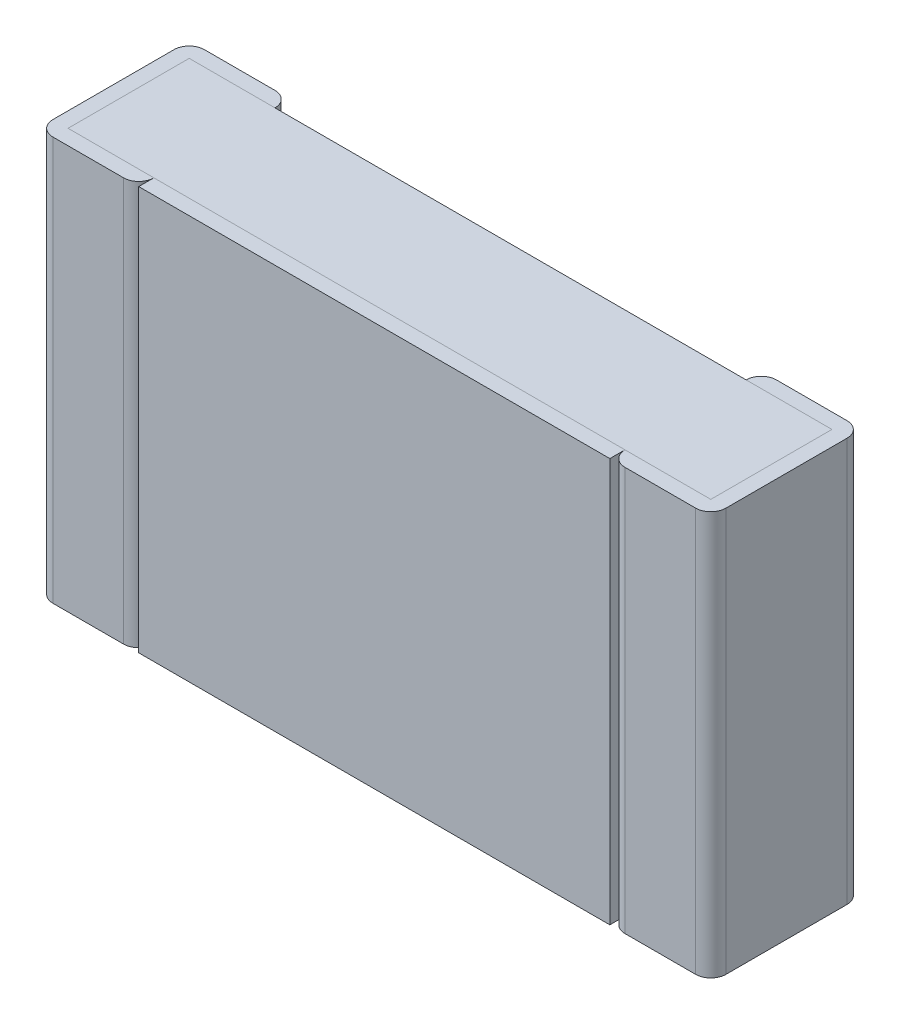
ISO-10303-21;
HEADER;
FILE_DESCRIPTION(('STEP AP214'),'2;1');
FILE_NAME('part.step','',(''),(''),'','','');
FILE_SCHEMA(('AUTOMOTIVE_DESIGN { 1 0 10303 214 1 1 1 1 }'));
ENDSEC;
DATA;
#1=APPLICATION_CONTEXT('core data for automotive mechanical design processes');
#2=APPLICATION_PROTOCOL_DEFINITION('international standard','automotive_design',2000,#1);
#3=PRODUCT_CONTEXT('',#1,'mechanical');
#4=PRODUCT('Part','Part','',(#3));
#5=PRODUCT_RELATED_PRODUCT_CATEGORY('part','',(#4));
#6=PRODUCT_DEFINITION_FORMATION('','',#4);
#7=PRODUCT_DEFINITION_CONTEXT('part definition',#1,'design');
#8=PRODUCT_DEFINITION('design','',#6,#7);
#9=PRODUCT_DEFINITION_SHAPE('','',#8);
#10=(LENGTH_UNIT() NAMED_UNIT(*) SI_UNIT(.MILLI.,.METRE.));
#11=(NAMED_UNIT(*) PLANE_ANGLE_UNIT() SI_UNIT($,.RADIAN.));
#12=(NAMED_UNIT(*) SI_UNIT($,.STERADIAN.) SOLID_ANGLE_UNIT());
#13=UNCERTAINTY_MEASURE_WITH_UNIT(LENGTH_MEASURE(1.E-05),#10,'distance_accuracy_value','');
#14=(GEOMETRIC_REPRESENTATION_CONTEXT(3) GLOBAL_UNCERTAINTY_ASSIGNED_CONTEXT((#13)) GLOBAL_UNIT_ASSIGNED_CONTEXT((#10,
#11,#12)) REPRESENTATION_CONTEXT('',''));
#15=CARTESIAN_POINT('',(0.,0.,0.));
#16=DIRECTION('',(0.,0.,1.));
#17=DIRECTION('',(1.,0.,0.));
#18=AXIS2_PLACEMENT_3D('',#15,#16,#17);
#19=CARTESIAN_POINT('',(-1.,-0.6,0.));
#20=DIRECTION('',(1.,0.,0.));
#21=DIRECTION('',(0.,1.,0.));
#22=AXIS2_PLACEMENT_3D('',#19,#20,#21);
#23=PLANE('',#22);
#24=DIRECTION('',(0.,1.,0.));
#25=VECTOR('',#24,1.);
#26=CARTESIAN_POINT('',(-1.,-0.6,0.405));
#27=LINE('',#26,#25);
#28=CARTESIAN_POINT('',(-1.,-0.6,0.405));
#29=VERTEX_POINT('',#28);
#30=CARTESIAN_POINT('',(-1.,0.6,0.405));
#31=VERTEX_POINT('',#30);
#32=EDGE_CURVE('E11',#29,#31,#27,.T.);
#33=ORIENTED_EDGE('',*,*,#32,.T.);
#34=DIRECTION('',(0.,0.,1.));
#35=VECTOR('',#34,1.);
#36=CARTESIAN_POINT('',(-1.,0.6,0.));
#37=LINE('',#36,#35);
#38=CARTESIAN_POINT('',(-1.,0.6,0.045));
#39=VERTEX_POINT('',#38);
#40=EDGE_CURVE('E41',#39,#31,#37,.T.);
#41=ORIENTED_EDGE('',*,*,#40,.F.);
#42=DIRECTION('',(0.,1.,0.));
#43=VECTOR('',#42,1.);
#44=CARTESIAN_POINT('',(-1.,-0.6,0.045));
#45=LINE('',#44,#43);
#46=CARTESIAN_POINT('',(-1.,-0.6,0.045));
#47=VERTEX_POINT('',#46);
#48=EDGE_CURVE('E223',#47,#39,#45,.T.);
#49=ORIENTED_EDGE('',*,*,#48,.F.);
#50=DIRECTION('',(0.,0.,1.));
#51=VECTOR('',#50,1.);
#52=CARTESIAN_POINT('',(-1.,-0.6,0.));
#53=LINE('',#52,#51);
#54=EDGE_CURVE('E27',#47,#29,#53,.T.);
#55=ORIENTED_EDGE('',*,*,#54,.T.);
#56=EDGE_LOOP('',(#33,#41,#49,#55));
#57=FACE_BOUND('',#56,.T.);
#58=ADVANCED_FACE('F16',(#57),#23,.F.);
#59=CARTESIAN_POINT('',(-1.,-0.6,0.));
#60=DIRECTION('',(0.,1.,0.));
#61=DIRECTION('',(1.,0.,0.));
#62=AXIS2_PLACEMENT_3D('',#59,#60,#61);
#63=PLANE('',#62);
#64=CARTESIAN_POINT('',(-0.745,-0.6,0.045));
#65=DIRECTION('',(0.,1.,0.));
#66=DIRECTION('',(0.,0.,1.));
#67=AXIS2_PLACEMENT_3D('',#64,#65,#66);
#68=CIRCLE('',#67,0.045);
#69=CARTESIAN_POINT('',(-0.7,-0.6,0.045));
#70=VERTEX_POINT('',#69);
#71=CARTESIAN_POINT('',(-0.745,-0.6,0.));
#72=VERTEX_POINT('',#71);
#73=EDGE_CURVE('E301',#70,#72,#68,.T.);
#74=ORIENTED_EDGE('',*,*,#73,.F.);
#75=DIRECTION('',(1.,0.,0.));
#76=VECTOR('',#75,1.);
#77=CARTESIAN_POINT('',(-0.955,-0.6,0.045));
#78=LINE('',#77,#76);
#79=CARTESIAN_POINT('',(-0.955,-0.6,0.045));
#80=VERTEX_POINT('',#79);
#81=EDGE_CURVE('E207',#80,#70,#78,.T.);
#82=ORIENTED_EDGE('',*,*,#81,.F.);
#83=DIRECTION('',(0.,0.,1.));
#84=VECTOR('',#83,1.);
#85=CARTESIAN_POINT('',(-0.955,-0.6,0.045));
#86=LINE('',#85,#84);
#87=CARTESIAN_POINT('',(-0.955,-0.6,0.405));
#88=VERTEX_POINT('',#87);
#89=EDGE_CURVE('E277',#80,#88,#86,.T.);
#90=ORIENTED_EDGE('',*,*,#89,.T.);
#91=DIRECTION('',(1.,0.,0.));
#92=VECTOR('',#91,1.);
#93=CARTESIAN_POINT('',(-0.955,-0.6,0.405));
#94=LINE('',#93,#92);
#95=CARTESIAN_POINT('',(-0.7,-0.6,0.405));
#96=VERTEX_POINT('',#95);
#97=EDGE_CURVE('E237',#88,#96,#94,.T.);
#98=ORIENTED_EDGE('',*,*,#97,.T.);
#99=CARTESIAN_POINT('',(-0.745,-0.6,0.405));
#100=DIRECTION('',(0.,-1.,0.));
#101=DIRECTION('',(0.,0.,1.));
#102=AXIS2_PLACEMENT_3D('',#99,#100,#101);
#103=CIRCLE('',#102,0.045);
#104=CARTESIAN_POINT('',(-0.745,-0.6,0.45));
#105=VERTEX_POINT('',#104);
#106=EDGE_CURVE('E233',#96,#105,#103,.T.);
#107=ORIENTED_EDGE('',*,*,#106,.T.);
#108=DIRECTION('',(1.,0.,0.));
#109=VECTOR('',#108,1.);
#110=CARTESIAN_POINT('',(-1.,-0.6,0.45));
#111=LINE('',#110,#109);
#112=CARTESIAN_POINT('',(-0.955,-0.6,0.45));
#113=VERTEX_POINT('',#112);
#114=EDGE_CURVE('E212',#113,#105,#111,.T.);
#115=ORIENTED_EDGE('',*,*,#114,.F.);
#116=CARTESIAN_POINT('',(-0.955,-0.6,0.405));
#117=DIRECTION('',(0.,1.,0.));
#118=DIRECTION('',(0.,0.,1.));
#119=AXIS2_PLACEMENT_3D('',#116,#117,#118);
#120=CIRCLE('',#119,0.045);
#121=EDGE_CURVE('E224',#29,#113,#120,.T.);
#122=ORIENTED_EDGE('',*,*,#121,.F.);
#123=ORIENTED_EDGE('',*,*,#54,.F.);
#124=CARTESIAN_POINT('',(-0.955,-0.6,0.045));
#125=DIRECTION('',(0.,-1.,0.));
#126=DIRECTION('',(0.,0.,1.));
#127=AXIS2_PLACEMENT_3D('',#124,#125,#126);
#128=CIRCLE('',#127,0.045);
#129=CARTESIAN_POINT('',(-0.955,-0.6,0.));
#130=VERTEX_POINT('',#129);
#131=EDGE_CURVE('E238',#47,#130,#128,.T.);
#132=ORIENTED_EDGE('',*,*,#131,.T.);
#133=DIRECTION('',(1.,0.,0.));
#134=VECTOR('',#133,1.);
#135=CARTESIAN_POINT('',(-1.,-0.6,0.));
#136=LINE('',#135,#134);
#137=EDGE_CURVE('E258',#130,#72,#136,.T.);
#138=ORIENTED_EDGE('',*,*,#137,.T.);
#139=EDGE_LOOP('',(#74,#82,#90,#98,#107,#115,#122,#123,#132,#138));
#140=FACE_BOUND('',#139,.T.);
#141=ADVANCED_FACE('F362',(#140),#63,.F.);
#142=CARTESIAN_POINT('',(-0.955,-0.6,0.045));
#143=DIRECTION('',(0.,1.,0.));
#144=DIRECTION('',(-1.,0.,0.));
#145=AXIS2_PLACEMENT_3D('',#142,#143,#144);
#146=CYLINDRICAL_SURFACE('',#145,0.045);
#147=ORIENTED_EDGE('',*,*,#48,.T.);
#148=CARTESIAN_POINT('',(-0.955,0.6,0.045));
#149=DIRECTION('',(0.,-1.,0.));
#150=DIRECTION('',(0.,0.,1.));
#151=AXIS2_PLACEMENT_3D('',#148,#149,#150);
#152=CIRCLE('',#151,0.045);
#153=CARTESIAN_POINT('',(-0.955,0.6,0.));
#154=VERTEX_POINT('',#153);
#155=EDGE_CURVE('E219',#39,#154,#152,.T.);
#156=ORIENTED_EDGE('',*,*,#155,.T.);
#157=DIRECTION('',(0.,1.,0.));
#158=VECTOR('',#157,1.);
#159=CARTESIAN_POINT('',(-0.955,-0.6,0.));
#160=LINE('',#159,#158);
#161=EDGE_CURVE('E202',#130,#154,#160,.T.);
#162=ORIENTED_EDGE('',*,*,#161,.F.);
#163=ORIENTED_EDGE('',*,*,#131,.F.);
#164=EDGE_LOOP('',(#147,#156,#162,#163));
#165=FACE_BOUND('',#164,.T.);
#166=ADVANCED_FACE('F685',(#165),#146,.T.);
#167=CARTESIAN_POINT('',(-0.955,-0.6,0.405));
#168=DIRECTION('',(0.,1.,0.));
#169=DIRECTION('',(-1.,0.,0.));
#170=AXIS2_PLACEMENT_3D('',#167,#168,#169);
#171=CYLINDRICAL_SURFACE('',#170,0.045);
#172=ORIENTED_EDGE('',*,*,#121,.T.);
#173=DIRECTION('',(0.,1.,0.));
#174=VECTOR('',#173,1.);
#175=CARTESIAN_POINT('',(-0.955,-0.6,0.45));
#176=LINE('',#175,#174);
#177=CARTESIAN_POINT('',(-0.955,0.6,0.45));
#178=VERTEX_POINT('',#177);
#179=EDGE_CURVE('E274',#113,#178,#176,.T.);
#180=ORIENTED_EDGE('',*,*,#179,.T.);
#181=CARTESIAN_POINT('',(-0.955,0.6,0.405));
#182=DIRECTION('',(0.,1.,0.));
#183=DIRECTION('',(0.,0.,1.));
#184=AXIS2_PLACEMENT_3D('',#181,#182,#183);
#185=CIRCLE('',#184,0.045);
#186=EDGE_CURVE('E200',#31,#178,#185,.T.);
#187=ORIENTED_EDGE('',*,*,#186,.F.);
#188=ORIENTED_EDGE('',*,*,#32,.F.);
#189=EDGE_LOOP('',(#172,#180,#187,#188));
#190=FACE_BOUND('',#189,.T.);
#191=ADVANCED_FACE('F675',(#190),#171,.T.);
#192=CARTESIAN_POINT('',(-1.,0.6,0.));
#193=DIRECTION('',(0.,1.,0.));
#194=DIRECTION('',(1.,0.,0.));
#195=AXIS2_PLACEMENT_3D('',#192,#193,#194);
#196=PLANE('',#195);
#197=DIRECTION('',(1.,0.,0.));
#198=VECTOR('',#197,1.);
#199=CARTESIAN_POINT('',(-1.,0.6,0.));
#200=LINE('',#199,#198);
#201=CARTESIAN_POINT('',(-0.745,0.6,0.));
#202=VERTEX_POINT('',#201);
#203=EDGE_CURVE('E206',#154,#202,#200,.T.);
#204=ORIENTED_EDGE('',*,*,#203,.F.);
#205=ORIENTED_EDGE('',*,*,#155,.F.);
#206=ORIENTED_EDGE('',*,*,#40,.T.);
#207=ORIENTED_EDGE('',*,*,#186,.T.);
#208=DIRECTION('',(1.,0.,0.));
#209=VECTOR('',#208,1.);
#210=CARTESIAN_POINT('',(-1.,0.6,0.45));
#211=LINE('',#210,#209);
#212=CARTESIAN_POINT('',(-0.745,0.6,0.45));
#213=VERTEX_POINT('',#212);
#214=EDGE_CURVE('E297',#178,#213,#211,.T.);
#215=ORIENTED_EDGE('',*,*,#214,.T.);
#216=CARTESIAN_POINT('',(-0.745,0.6,0.405));
#217=DIRECTION('',(0.,-1.,0.));
#218=DIRECTION('',(0.,0.,1.));
#219=AXIS2_PLACEMENT_3D('',#216,#217,#218);
#220=CIRCLE('',#219,0.045);
#221=CARTESIAN_POINT('',(-0.7,0.6,0.405));
#222=VERTEX_POINT('',#221);
#223=EDGE_CURVE('E305',#222,#213,#220,.T.);
#224=ORIENTED_EDGE('',*,*,#223,.F.);
#225=DIRECTION('',(1.,0.,0.));
#226=VECTOR('',#225,1.);
#227=CARTESIAN_POINT('',(-0.955,0.6,0.405));
#228=LINE('',#227,#226);
#229=CARTESIAN_POINT('',(-0.955,0.6,0.405));
#230=VERTEX_POINT('',#229);
#231=EDGE_CURVE('E334',#230,#222,#228,.T.);
#232=ORIENTED_EDGE('',*,*,#231,.F.);
#233=DIRECTION('',(0.,0.,1.));
#234=VECTOR('',#233,1.);
#235=CARTESIAN_POINT('',(-0.955,0.6,0.045));
#236=LINE('',#235,#234);
#237=CARTESIAN_POINT('',(-0.955,0.6,0.045));
#238=VERTEX_POINT('',#237);
#239=EDGE_CURVE('E310',#238,#230,#236,.T.);
#240=ORIENTED_EDGE('',*,*,#239,.F.);
#241=DIRECTION('',(1.,0.,0.));
#242=VECTOR('',#241,1.);
#243=CARTESIAN_POINT('',(-0.955,0.6,0.045));
#244=LINE('',#243,#242);
#245=CARTESIAN_POINT('',(-0.7,0.6,0.045));
#246=VERTEX_POINT('',#245);
#247=EDGE_CURVE('E293',#238,#246,#244,.T.);
#248=ORIENTED_EDGE('',*,*,#247,.T.);
#249=CARTESIAN_POINT('',(-0.745,0.6,0.045));
#250=DIRECTION('',(0.,1.,0.));
#251=DIRECTION('',(0.,0.,1.));
#252=AXIS2_PLACEMENT_3D('',#249,#250,#251);
#253=CIRCLE('',#252,0.045);
#254=EDGE_CURVE('E205',#246,#202,#253,.T.);
#255=ORIENTED_EDGE('',*,*,#254,.T.);
#256=EDGE_LOOP('',(#204,#205,#206,#207,#215,#224,#232,#240,#248,#255));
#257=FACE_BOUND('',#256,.T.);
#258=ADVANCED_FACE('F494',(#257),#196,.T.);
#259=CARTESIAN_POINT('',(-1.,-0.6,0.));
#260=DIRECTION('',(0.,0.,1.));
#261=DIRECTION('',(1.,0.,0.));
#262=AXIS2_PLACEMENT_3D('',#259,#260,#261);
#263=PLANE('',#262);
#264=DIRECTION('',(0.,1.,0.));
#265=VECTOR('',#264,1.);
#266=CARTESIAN_POINT('',(-0.745,-0.6,0.));
#267=LINE('',#266,#265);
#268=EDGE_CURVE('E263',#72,#202,#267,.T.);
#269=ORIENTED_EDGE('',*,*,#268,.F.);
#270=ORIENTED_EDGE('',*,*,#137,.F.);
#271=ORIENTED_EDGE('',*,*,#161,.T.);
#272=ORIENTED_EDGE('',*,*,#203,.T.);
#273=EDGE_LOOP('',(#269,#270,#271,#272));
#274=FACE_BOUND('',#273,.T.);
#275=ADVANCED_FACE('F370',(#274),#263,.F.);
#276=CARTESIAN_POINT('',(-0.745,-0.6,0.045));
#277=DIRECTION('',(0.,1.,0.));
#278=DIRECTION('',(1.,0.,0.));
#279=AXIS2_PLACEMENT_3D('',#276,#277,#278);
#280=CYLINDRICAL_SURFACE('',#279,0.045);
#281=ORIENTED_EDGE('',*,*,#73,.T.);
#282=ORIENTED_EDGE('',*,*,#268,.T.);
#283=ORIENTED_EDGE('',*,*,#254,.F.);
#284=DIRECTION('',(0.,1.,0.));
#285=VECTOR('',#284,1.);
#286=CARTESIAN_POINT('',(-0.7,-0.6,0.045));
#287=LINE('',#286,#285);
#288=EDGE_CURVE('E330',#70,#246,#287,.T.);
#289=ORIENTED_EDGE('',*,*,#288,.F.);
#290=EDGE_LOOP('',(#281,#282,#283,#289));
#291=FACE_BOUND('',#290,.T.);
#292=ADVANCED_FACE('F374',(#291),#280,.T.);
#293=CARTESIAN_POINT('',(-0.955,-0.6,0.045));
#294=DIRECTION('',(0.,1.,0.));
#295=DIRECTION('',(1.,0.,0.));
#296=AXIS2_PLACEMENT_3D('',#293,#294,#295);
#297=PLANE('',#296);
#298=DIRECTION('',(1.,0.,0.));
#299=VECTOR('',#298,1.);
#300=CARTESIAN_POINT('',(-0.955,-0.6,0.045));
#301=LINE('',#300,#299);
#302=CARTESIAN_POINT('',(0.7,-0.6,0.045));
#303=VERTEX_POINT('',#302);
#304=EDGE_CURVE('E259',#70,#303,#301,.T.);
#305=ORIENTED_EDGE('',*,*,#304,.T.);
#306=DIRECTION('',(1.,0.,0.));
#307=VECTOR('',#306,1.);
#308=CARTESIAN_POINT('',(-0.955,-0.6,0.045));
#309=LINE('',#308,#307);
#310=CARTESIAN_POINT('',(0.955,-0.6,0.045));
#311=VERTEX_POINT('',#310);
#312=EDGE_CURVE('E264',#303,#311,#309,.T.);
#313=ORIENTED_EDGE('',*,*,#312,.T.);
#314=DIRECTION('',(0.,0.,1.));
#315=VECTOR('',#314,1.);
#316=CARTESIAN_POINT('',(0.955,-0.6,0.045));
#317=LINE('',#316,#315);
#318=CARTESIAN_POINT('',(0.955,-0.6,0.405));
#319=VERTEX_POINT('',#318);
#320=EDGE_CURVE('E211',#311,#319,#317,.T.);
#321=ORIENTED_EDGE('',*,*,#320,.T.);
#322=DIRECTION('',(1.,0.,0.));
#323=VECTOR('',#322,1.);
#324=CARTESIAN_POINT('',(-0.955,-0.6,0.405));
#325=LINE('',#324,#323);
#326=CARTESIAN_POINT('',(0.7,-0.6,0.405));
#327=VERTEX_POINT('',#326);
#328=EDGE_CURVE('E178',#327,#319,#325,.T.);
#329=ORIENTED_EDGE('',*,*,#328,.F.);
#330=DIRECTION('',(1.,0.,0.));
#331=VECTOR('',#330,1.);
#332=CARTESIAN_POINT('',(-0.7,-0.6,0.405));
#333=LINE('',#332,#331);
#334=EDGE_CURVE('E196',#96,#327,#333,.T.);
#335=ORIENTED_EDGE('',*,*,#334,.F.);
#336=ORIENTED_EDGE('',*,*,#97,.F.);
#337=ORIENTED_EDGE('',*,*,#89,.F.);
#338=ORIENTED_EDGE('',*,*,#81,.T.);
#339=EDGE_LOOP('',(#305,#313,#321,#329,#335,#336,#337,#338));
#340=FACE_BOUND('',#339,.T.);
#341=ADVANCED_FACE('F536',(#340),#297,.F.);
#342=CARTESIAN_POINT('',(-1.,-0.6,0.45));
#343=DIRECTION('',(0.,0.,1.));
#344=DIRECTION('',(1.,0.,0.));
#345=AXIS2_PLACEMENT_3D('',#342,#343,#344);
#346=PLANE('',#345);
#347=ORIENTED_EDGE('',*,*,#214,.F.);
#348=ORIENTED_EDGE('',*,*,#179,.F.);
#349=ORIENTED_EDGE('',*,*,#114,.T.);
#350=DIRECTION('',(0.,1.,0.));
#351=VECTOR('',#350,1.);
#352=CARTESIAN_POINT('',(-0.745,-0.6,0.45));
#353=LINE('',#352,#351);
#354=EDGE_CURVE('E241',#105,#213,#353,.T.);
#355=ORIENTED_EDGE('',*,*,#354,.T.);
#356=EDGE_LOOP('',(#347,#348,#349,#355));
#357=FACE_BOUND('',#356,.T.);
#358=ADVANCED_FACE('F540',(#357),#346,.T.);
#359=CARTESIAN_POINT('',(-0.745,-0.6,0.405));
#360=DIRECTION('',(0.,1.,0.));
#361=DIRECTION('',(1.,0.,0.));
#362=AXIS2_PLACEMENT_3D('',#359,#360,#361);
#363=CYLINDRICAL_SURFACE('',#362,0.045);
#364=DIRECTION('',(0.,1.,0.));
#365=VECTOR('',#364,1.);
#366=CARTESIAN_POINT('',(-0.7,-0.6,0.405));
#367=LINE('',#366,#365);
#368=EDGE_CURVE('E309',#96,#222,#367,.T.);
#369=ORIENTED_EDGE('',*,*,#368,.T.);
#370=ORIENTED_EDGE('',*,*,#223,.T.);
#371=ORIENTED_EDGE('',*,*,#354,.F.);
#372=ORIENTED_EDGE('',*,*,#106,.F.);
#373=EDGE_LOOP('',(#369,#370,#371,#372));
#374=FACE_BOUND('',#373,.T.);
#375=ADVANCED_FACE('F584',(#374),#363,.T.);
#376=CARTESIAN_POINT('',(-0.955,0.6,0.045));
#377=DIRECTION('',(0.,1.,0.));
#378=DIRECTION('',(1.,0.,0.));
#379=AXIS2_PLACEMENT_3D('',#376,#377,#378);
#380=PLANE('',#379);
#381=ORIENTED_EDGE('',*,*,#247,.F.);
#382=ORIENTED_EDGE('',*,*,#239,.T.);
#383=ORIENTED_EDGE('',*,*,#231,.T.);
#384=DIRECTION('',(1.,0.,0.));
#385=VECTOR('',#384,1.);
#386=CARTESIAN_POINT('',(-0.7,0.6,0.405));
#387=LINE('',#386,#385);
#388=CARTESIAN_POINT('',(0.7,0.6,0.405));
#389=VERTEX_POINT('',#388);
#390=EDGE_CURVE('E331',#222,#389,#387,.T.);
#391=ORIENTED_EDGE('',*,*,#390,.T.);
#392=DIRECTION('',(1.,0.,0.));
#393=VECTOR('',#392,1.);
#394=CARTESIAN_POINT('',(-0.955,0.6,0.405));
#395=LINE('',#394,#393);
#396=CARTESIAN_POINT('',(0.955,0.6,0.405));
#397=VERTEX_POINT('',#396);
#398=EDGE_CURVE('E329',#389,#397,#395,.T.);
#399=ORIENTED_EDGE('',*,*,#398,.T.);
#400=DIRECTION('',(0.,0.,1.));
#401=VECTOR('',#400,1.);
#402=CARTESIAN_POINT('',(0.955,0.6,0.045));
#403=LINE('',#402,#401);
#404=CARTESIAN_POINT('',(0.955,0.6,0.045));
#405=VERTEX_POINT('',#404);
#406=EDGE_CURVE('E228',#405,#397,#403,.T.);
#407=ORIENTED_EDGE('',*,*,#406,.F.);
#408=DIRECTION('',(1.,0.,0.));
#409=VECTOR('',#408,1.);
#410=CARTESIAN_POINT('',(-0.955,0.6,0.045));
#411=LINE('',#410,#409);
#412=CARTESIAN_POINT('',(0.7,0.6,0.045));
#413=VERTEX_POINT('',#412);
#414=EDGE_CURVE('E251',#413,#405,#411,.T.);
#415=ORIENTED_EDGE('',*,*,#414,.F.);
#416=DIRECTION('',(1.,0.,0.));
#417=VECTOR('',#416,1.);
#418=CARTESIAN_POINT('',(-0.955,0.6,0.045));
#419=LINE('',#418,#417);
#420=EDGE_CURVE('E325',#246,#413,#419,.T.);
#421=ORIENTED_EDGE('',*,*,#420,.F.);
#422=EDGE_LOOP('',(#381,#382,#383,#391,#399,#407,#415,#421));
#423=FACE_BOUND('',#422,.T.);
#424=ADVANCED_FACE('F456',(#423),#380,.T.);
#425=CARTESIAN_POINT('',(-0.955,-0.6,0.045));
#426=DIRECTION('',(0.,0.,1.));
#427=DIRECTION('',(1.,0.,0.));
#428=AXIS2_PLACEMENT_3D('',#425,#426,#427);
#429=PLANE('',#428);
#430=ORIENTED_EDGE('',*,*,#420,.T.);
#431=DIRECTION('',(0.,1.,0.));
#432=VECTOR('',#431,1.);
#433=CARTESIAN_POINT('',(0.7,-0.6,0.045));
#434=LINE('',#433,#432);
#435=EDGE_CURVE('E252',#303,#413,#434,.T.);
#436=ORIENTED_EDGE('',*,*,#435,.F.);
#437=ORIENTED_EDGE('',*,*,#304,.F.);
#438=ORIENTED_EDGE('',*,*,#288,.T.);
#439=EDGE_LOOP('',(#430,#436,#437,#438));
#440=FACE_BOUND('',#439,.T.);
#441=ADVANCED_FACE('F572',(#440),#429,.F.);
#442=CARTESIAN_POINT('',(0.7,-0.6,0.));
#443=DIRECTION('',(0.,1.,0.));
#444=DIRECTION('',(1.,0.,0.));
#445=AXIS2_PLACEMENT_3D('',#442,#443,#444);
#446=PLANE('',#445);
#447=CARTESIAN_POINT('',(0.955,-0.6,0.045));
#448=DIRECTION('',(0.,1.,0.));
#449=DIRECTION('',(0.,0.,1.));
#450=AXIS2_PLACEMENT_3D('',#447,#448,#449);
#451=CIRCLE('',#450,0.045);
#452=CARTESIAN_POINT('',(1.,-0.6,0.045));
#453=VERTEX_POINT('',#452);
#454=CARTESIAN_POINT('',(0.955,-0.6,0.));
#455=VERTEX_POINT('',#454);
#456=EDGE_CURVE('E218',#453,#455,#451,.T.);
#457=ORIENTED_EDGE('',*,*,#456,.F.);
#458=DIRECTION('',(0.,0.,1.));
#459=VECTOR('',#458,1.);
#460=CARTESIAN_POINT('',(1.,-0.6,0.));
#461=LINE('',#460,#459);
#462=CARTESIAN_POINT('',(1.,-0.6,0.405));
#463=VERTEX_POINT('',#462);
#464=EDGE_CURVE('E337',#453,#463,#461,.T.);
#465=ORIENTED_EDGE('',*,*,#464,.T.);
#466=CARTESIAN_POINT('',(0.955,-0.6,0.405));
#467=DIRECTION('',(0.,-1.,0.));
#468=DIRECTION('',(0.,0.,1.));
#469=AXIS2_PLACEMENT_3D('',#466,#467,#468);
#470=CIRCLE('',#469,0.045);
#471=CARTESIAN_POINT('',(0.955,-0.6,0.45));
#472=VERTEX_POINT('',#471);
#473=EDGE_CURVE('E143',#463,#472,#470,.T.);
#474=ORIENTED_EDGE('',*,*,#473,.T.);
#475=DIRECTION('',(1.,0.,0.));
#476=VECTOR('',#475,1.);
#477=CARTESIAN_POINT('',(0.7,-0.6,0.45));
#478=LINE('',#477,#476);
#479=CARTESIAN_POINT('',(0.745,-0.6,0.45));
#480=VERTEX_POINT('',#479);
#481=EDGE_CURVE('E140',#480,#472,#478,.T.);
#482=ORIENTED_EDGE('',*,*,#481,.F.);
#483=CARTESIAN_POINT('',(0.745,-0.6,0.405));
#484=DIRECTION('',(0.,1.,0.));
#485=DIRECTION('',(0.,0.,1.));
#486=AXIS2_PLACEMENT_3D('',#483,#484,#485);
#487=CIRCLE('',#486,0.045);
#488=EDGE_CURVE('E126',#327,#480,#487,.T.);
#489=ORIENTED_EDGE('',*,*,#488,.F.);
#490=ORIENTED_EDGE('',*,*,#328,.T.);
#491=ORIENTED_EDGE('',*,*,#320,.F.);
#492=ORIENTED_EDGE('',*,*,#312,.F.);
#493=CARTESIAN_POINT('',(0.745,-0.6,0.045));
#494=DIRECTION('',(0.,-1.,0.));
#495=DIRECTION('',(0.,0.,1.));
#496=AXIS2_PLACEMENT_3D('',#493,#494,#495);
#497=CIRCLE('',#496,0.045);
#498=CARTESIAN_POINT('',(0.745,-0.6,0.));
#499=VERTEX_POINT('',#498);
#500=EDGE_CURVE('E176',#303,#499,#497,.T.);
#501=ORIENTED_EDGE('',*,*,#500,.T.);
#502=DIRECTION('',(1.,0.,0.));
#503=VECTOR('',#502,1.);
#504=CARTESIAN_POINT('',(0.7,-0.6,0.));
#505=LINE('',#504,#503);
#506=EDGE_CURVE('E179',#499,#455,#505,.T.);
#507=ORIENTED_EDGE('',*,*,#506,.T.);
#508=EDGE_LOOP('',(#457,#465,#474,#482,#489,#490,#491,#492,#501,#507));
#509=FACE_BOUND('',#508,.T.);
#510=ADVANCED_FACE('F141',(#509),#446,.F.);
#511=CARTESIAN_POINT('',(-0.7,-0.6,0.405));
#512=DIRECTION('',(0.,1.,0.));
#513=DIRECTION('',(1.,0.,0.));
#514=AXIS2_PLACEMENT_3D('',#511,#512,#513);
#515=PLANE('',#514);
#516=DIRECTION('',(0.,0.,1.));
#517=VECTOR('',#516,1.);
#518=CARTESIAN_POINT('',(0.7,-0.6,0.405));
#519=LINE('',#518,#517);
#520=CARTESIAN_POINT('',(0.7,-0.6,0.45));
#521=VERTEX_POINT('',#520);
#522=EDGE_CURVE('E188',#327,#521,#519,.T.);
#523=ORIENTED_EDGE('',*,*,#522,.T.);
#524=DIRECTION('',(1.,0.,0.));
#525=VECTOR('',#524,1.);
#526=CARTESIAN_POINT('',(-0.7,-0.6,0.45));
#527=LINE('',#526,#525);
#528=CARTESIAN_POINT('',(-0.7,-0.6,0.45));
#529=VERTEX_POINT('',#528);
#530=EDGE_CURVE('E165',#529,#521,#527,.T.);
#531=ORIENTED_EDGE('',*,*,#530,.F.);
#532=DIRECTION('',(0.,0.,1.));
#533=VECTOR('',#532,1.);
#534=CARTESIAN_POINT('',(-0.7,-0.6,0.405));
#535=LINE('',#534,#533);
#536=EDGE_CURVE('E288',#96,#529,#535,.T.);
#537=ORIENTED_EDGE('',*,*,#536,.F.);
#538=ORIENTED_EDGE('',*,*,#334,.T.);
#539=EDGE_LOOP('',(#523,#531,#537,#538));
#540=FACE_BOUND('',#539,.T.);
#541=ADVANCED_FACE('F564',(#540),#515,.F.);
#542=CARTESIAN_POINT('',(-0.7,-0.6,0.405));
#543=DIRECTION('',(1.,0.,0.));
#544=DIRECTION('',(0.,1.,0.));
#545=AXIS2_PLACEMENT_3D('',#542,#543,#544);
#546=PLANE('',#545);
#547=DIRECTION('',(0.,1.,0.));
#548=VECTOR('',#547,1.);
#549=CARTESIAN_POINT('',(-0.7,-0.6,0.45));
#550=LINE('',#549,#548);
#551=CARTESIAN_POINT('',(-0.7,0.6,0.45));
#552=VERTEX_POINT('',#551);
#553=EDGE_CURVE('E285',#529,#552,#550,.T.);
#554=ORIENTED_EDGE('',*,*,#553,.T.);
#555=DIRECTION('',(0.,0.,1.));
#556=VECTOR('',#555,1.);
#557=CARTESIAN_POINT('',(-0.7,0.6,0.405));
#558=LINE('',#557,#556);
#559=EDGE_CURVE('E169',#222,#552,#558,.T.);
#560=ORIENTED_EDGE('',*,*,#559,.F.);
#561=ORIENTED_EDGE('',*,*,#368,.F.);
#562=ORIENTED_EDGE('',*,*,#536,.T.);
#563=EDGE_LOOP('',(#554,#560,#561,#562));
#564=FACE_BOUND('',#563,.T.);
#565=ADVANCED_FACE('F560',(#564),#546,.F.);
#566=CARTESIAN_POINT('',(0.7,0.6,0.));
#567=DIRECTION('',(0.,1.,0.));
#568=DIRECTION('',(1.,0.,0.));
#569=AXIS2_PLACEMENT_3D('',#566,#567,#568);
#570=PLANE('',#569);
#571=DIRECTION('',(1.,0.,0.));
#572=VECTOR('',#571,1.);
#573=CARTESIAN_POINT('',(0.7,0.6,0.));
#574=LINE('',#573,#572);
#575=CARTESIAN_POINT('',(0.745,0.6,0.));
#576=VERTEX_POINT('',#575);
#577=CARTESIAN_POINT('',(0.955,0.6,0.));
#578=VERTEX_POINT('',#577);
#579=EDGE_CURVE('E213',#576,#578,#574,.T.);
#580=ORIENTED_EDGE('',*,*,#579,.F.);
#581=CARTESIAN_POINT('',(0.745,0.6,0.045));
#582=DIRECTION('',(0.,-1.,0.));
#583=DIRECTION('',(0.,0.,1.));
#584=AXIS2_PLACEMENT_3D('',#581,#582,#583);
#585=CIRCLE('',#584,0.045);
#586=EDGE_CURVE('E232',#413,#576,#585,.T.);
#587=ORIENTED_EDGE('',*,*,#586,.F.);
#588=ORIENTED_EDGE('',*,*,#414,.T.);
#589=ORIENTED_EDGE('',*,*,#406,.T.);
#590=ORIENTED_EDGE('',*,*,#398,.F.);
#591=CARTESIAN_POINT('',(0.745,0.6,0.405));
#592=DIRECTION('',(0.,1.,0.));
#593=DIRECTION('',(0.,0.,1.));
#594=AXIS2_PLACEMENT_3D('',#591,#592,#593);
#595=CIRCLE('',#594,0.045);
#596=CARTESIAN_POINT('',(0.745,0.6,0.45));
#597=VERTEX_POINT('',#596);
#598=EDGE_CURVE('E225',#389,#597,#595,.T.);
#599=ORIENTED_EDGE('',*,*,#598,.T.);
#600=DIRECTION('',(1.,0.,0.));
#601=VECTOR('',#600,1.);
#602=CARTESIAN_POINT('',(0.7,0.6,0.45));
#603=LINE('',#602,#601);
#604=CARTESIAN_POINT('',(0.955,0.6,0.45));
#605=VERTEX_POINT('',#604);
#606=EDGE_CURVE('E152',#597,#605,#603,.T.);
#607=ORIENTED_EDGE('',*,*,#606,.T.);
#608=CARTESIAN_POINT('',(0.955,0.6,0.405));
#609=DIRECTION('',(0.,-1.,0.));
#610=DIRECTION('',(0.,0.,1.));
#611=AXIS2_PLACEMENT_3D('',#608,#609,#610);
#612=CIRCLE('',#611,0.045);
#613=CARTESIAN_POINT('',(1.,0.6,0.405));
#614=VERTEX_POINT('',#613);
#615=EDGE_CURVE('E148',#614,#605,#612,.T.);
#616=ORIENTED_EDGE('',*,*,#615,.F.);
#617=DIRECTION('',(0.,0.,1.));
#618=VECTOR('',#617,1.);
#619=CARTESIAN_POINT('',(1.,0.6,0.));
#620=LINE('',#619,#618);
#621=CARTESIAN_POINT('',(1.,0.6,0.045));
#622=VERTEX_POINT('',#621);
#623=EDGE_CURVE('E247',#622,#614,#620,.T.);
#624=ORIENTED_EDGE('',*,*,#623,.F.);
#625=CARTESIAN_POINT('',(0.955,0.6,0.045));
#626=DIRECTION('',(0.,1.,0.));
#627=DIRECTION('',(0.,0.,1.));
#628=AXIS2_PLACEMENT_3D('',#625,#626,#627);
#629=CIRCLE('',#628,0.045);
#630=EDGE_CURVE('E173',#622,#578,#629,.T.);
#631=ORIENTED_EDGE('',*,*,#630,.T.);
#632=EDGE_LOOP('',(#580,#587,#588,#589,#590,#599,#607,#616,#624,#631));
#633=FACE_BOUND('',#632,.T.);
#634=ADVANCED_FACE('F463',(#633),#570,.T.);
#635=CARTESIAN_POINT('',(-0.7,0.6,0.405));
#636=DIRECTION('',(0.,1.,0.));
#637=DIRECTION('',(1.,0.,0.));
#638=AXIS2_PLACEMENT_3D('',#635,#636,#637);
#639=PLANE('',#638);
#640=ORIENTED_EDGE('',*,*,#390,.F.);
#641=ORIENTED_EDGE('',*,*,#559,.T.);
#642=DIRECTION('',(1.,0.,0.));
#643=VECTOR('',#642,1.);
#644=CARTESIAN_POINT('',(-0.7,0.6,0.45));
#645=LINE('',#644,#643);
#646=CARTESIAN_POINT('',(0.7,0.6,0.45));
#647=VERTEX_POINT('',#646);
#648=EDGE_CURVE('E174',#552,#647,#645,.T.);
#649=ORIENTED_EDGE('',*,*,#648,.T.);
#650=DIRECTION('',(0.,0.,1.));
#651=VECTOR('',#650,1.);
#652=CARTESIAN_POINT('',(0.7,0.6,0.405));
#653=LINE('',#652,#651);
#654=EDGE_CURVE('E159',#389,#647,#653,.T.);
#655=ORIENTED_EDGE('',*,*,#654,.F.);
#656=EDGE_LOOP('',(#640,#641,#649,#655));
#657=FACE_BOUND('',#656,.T.);
#658=ADVANCED_FACE('F596',(#657),#639,.T.);
#659=CARTESIAN_POINT('',(0.745,-0.6,0.045));
#660=DIRECTION('',(0.,1.,0.));
#661=DIRECTION('',(-1.,0.,0.));
#662=AXIS2_PLACEMENT_3D('',#659,#660,#661);
#663=CYLINDRICAL_SURFACE('',#662,0.045);
#664=ORIENTED_EDGE('',*,*,#435,.T.);
#665=ORIENTED_EDGE('',*,*,#586,.T.);
#666=DIRECTION('',(0.,1.,0.));
#667=VECTOR('',#666,1.);
#668=CARTESIAN_POINT('',(0.745,-0.6,0.));
#669=LINE('',#668,#667);
#670=EDGE_CURVE('E217',#499,#576,#669,.T.);
#671=ORIENTED_EDGE('',*,*,#670,.F.);
#672=ORIENTED_EDGE('',*,*,#500,.F.);
#673=EDGE_LOOP('',(#664,#665,#671,#672));
#674=FACE_BOUND('',#673,.T.);
#675=ADVANCED_FACE('F18',(#674),#663,.T.);
#676=CARTESIAN_POINT('',(0.7,-0.6,0.));
#677=DIRECTION('',(0.,0.,1.));
#678=DIRECTION('',(1.,0.,0.));
#679=AXIS2_PLACEMENT_3D('',#676,#677,#678);
#680=PLANE('',#679);
#681=DIRECTION('',(0.,1.,0.));
#682=VECTOR('',#681,1.);
#683=CARTESIAN_POINT('',(0.955,-0.6,0.));
#684=LINE('',#683,#682);
#685=EDGE_CURVE('E246',#455,#578,#684,.T.);
#686=ORIENTED_EDGE('',*,*,#685,.F.);
#687=ORIENTED_EDGE('',*,*,#506,.F.);
#688=ORIENTED_EDGE('',*,*,#670,.T.);
#689=ORIENTED_EDGE('',*,*,#579,.T.);
#690=EDGE_LOOP('',(#686,#687,#688,#689));
#691=FACE_BOUND('',#690,.T.);
#692=ADVANCED_FACE('F749',(#691),#680,.F.);
#693=CARTESIAN_POINT('',(0.955,-0.6,0.045));
#694=DIRECTION('',(0.,1.,0.));
#695=DIRECTION('',(1.,0.,0.));
#696=AXIS2_PLACEMENT_3D('',#693,#694,#695);
#697=CYLINDRICAL_SURFACE('',#696,0.045);
#698=ORIENTED_EDGE('',*,*,#456,.T.);
#699=ORIENTED_EDGE('',*,*,#685,.T.);
#700=ORIENTED_EDGE('',*,*,#630,.F.);
#701=DIRECTION('',(0.,1.,0.));
#702=VECTOR('',#701,1.);
#703=CARTESIAN_POINT('',(1.,-0.6,0.045));
#704=LINE('',#703,#702);
#705=EDGE_CURVE('E242',#453,#622,#704,.T.);
#706=ORIENTED_EDGE('',*,*,#705,.F.);
#707=EDGE_LOOP('',(#698,#699,#700,#706));
#708=FACE_BOUND('',#707,.T.);
#709=ADVANCED_FACE('F730',(#708),#697,.T.);
#710=CARTESIAN_POINT('',(1.,-0.6,0.));
#711=DIRECTION('',(1.,0.,0.));
#712=DIRECTION('',(0.,1.,0.));
#713=AXIS2_PLACEMENT_3D('',#710,#711,#712);
#714=PLANE('',#713);
#715=ORIENTED_EDGE('',*,*,#464,.F.);
#716=ORIENTED_EDGE('',*,*,#705,.T.);
#717=ORIENTED_EDGE('',*,*,#623,.T.);
#718=DIRECTION('',(0.,1.,0.));
#719=VECTOR('',#718,1.);
#720=CARTESIAN_POINT('',(1.,-0.6,0.405));
#721=LINE('',#720,#719);
#722=EDGE_CURVE('E268',#463,#614,#721,.T.);
#723=ORIENTED_EDGE('',*,*,#722,.F.);
#724=EDGE_LOOP('',(#715,#716,#717,#723));
#725=FACE_BOUND('',#724,.T.);
#726=ADVANCED_FACE('F726',(#725),#714,.T.);
#727=CARTESIAN_POINT('',(0.955,-0.6,0.405));
#728=DIRECTION('',(0.,1.,0.));
#729=DIRECTION('',(1.,0.,0.));
#730=AXIS2_PLACEMENT_3D('',#727,#728,#729);
#731=CYLINDRICAL_SURFACE('',#730,0.045);
#732=ORIENTED_EDGE('',*,*,#722,.T.);
#733=ORIENTED_EDGE('',*,*,#615,.T.);
#734=DIRECTION('',(0.,1.,0.));
#735=VECTOR('',#734,1.);
#736=CARTESIAN_POINT('',(0.955,-0.6,0.45));
#737=LINE('',#736,#735);
#738=EDGE_CURVE('E137',#472,#605,#737,.T.);
#739=ORIENTED_EDGE('',*,*,#738,.F.);
#740=ORIENTED_EDGE('',*,*,#473,.F.);
#741=EDGE_LOOP('',(#732,#733,#739,#740));
#742=FACE_BOUND('',#741,.T.);
#743=ADVANCED_FACE('F729',(#742),#731,.T.);
#744=CARTESIAN_POINT('',(0.7,-0.6,0.45));
#745=DIRECTION('',(0.,0.,1.));
#746=DIRECTION('',(1.,0.,0.));
#747=AXIS2_PLACEMENT_3D('',#744,#745,#746);
#748=PLANE('',#747);
#749=ORIENTED_EDGE('',*,*,#606,.F.);
#750=DIRECTION('',(0.,1.,0.));
#751=VECTOR('',#750,1.);
#752=CARTESIAN_POINT('',(0.745,-0.6,0.45));
#753=LINE('',#752,#751);
#754=EDGE_CURVE('E20',#480,#597,#753,.T.);
#755=ORIENTED_EDGE('',*,*,#754,.F.);
#756=ORIENTED_EDGE('',*,*,#481,.T.);
#757=ORIENTED_EDGE('',*,*,#738,.T.);
#758=EDGE_LOOP('',(#749,#755,#756,#757));
#759=FACE_BOUND('',#758,.T.);
#760=ADVANCED_FACE('F150',(#759),#748,.T.);
#761=CARTESIAN_POINT('',(0.745,-0.6,0.405));
#762=DIRECTION('',(0.,1.,0.));
#763=DIRECTION('',(-1.,0.,0.));
#764=AXIS2_PLACEMENT_3D('',#761,#762,#763);
#765=CYLINDRICAL_SURFACE('',#764,0.045);
#766=ORIENTED_EDGE('',*,*,#488,.T.);
#767=ORIENTED_EDGE('',*,*,#754,.T.);
#768=ORIENTED_EDGE('',*,*,#598,.F.);
#769=DIRECTION('',(0.,1.,0.));
#770=VECTOR('',#769,1.);
#771=CARTESIAN_POINT('',(0.7,-0.6,0.405));
#772=LINE('',#771,#770);
#773=EDGE_CURVE('E132',#327,#389,#772,.T.);
#774=ORIENTED_EDGE('',*,*,#773,.F.);
#775=EDGE_LOOP('',(#766,#767,#768,#774));
#776=FACE_BOUND('',#775,.T.);
#777=ADVANCED_FACE('F128',(#776),#765,.T.);
#778=CARTESIAN_POINT('',(0.7,-0.6,0.405));
#779=DIRECTION('',(1.,0.,0.));
#780=DIRECTION('',(0.,1.,0.));
#781=AXIS2_PLACEMENT_3D('',#778,#779,#780);
#782=PLANE('',#781);
#783=ORIENTED_EDGE('',*,*,#522,.F.);
#784=ORIENTED_EDGE('',*,*,#773,.T.);
#785=ORIENTED_EDGE('',*,*,#654,.T.);
#786=DIRECTION('',(0.,1.,0.));
#787=VECTOR('',#786,1.);
#788=CARTESIAN_POINT('',(0.7,-0.6,0.45));
#789=LINE('',#788,#787);
#790=EDGE_CURVE('E284',#521,#647,#789,.T.);
#791=ORIENTED_EDGE('',*,*,#790,.F.);
#792=EDGE_LOOP('',(#783,#784,#785,#791));
#793=FACE_BOUND('',#792,.T.);
#794=ADVANCED_FACE('F549',(#793),#782,.T.);
#795=CARTESIAN_POINT('',(-0.7,-0.6,0.45));
#796=DIRECTION('',(0.,0.,1.));
#797=DIRECTION('',(1.,0.,0.));
#798=AXIS2_PLACEMENT_3D('',#795,#796,#797);
#799=PLANE('',#798);
#800=ORIENTED_EDGE('',*,*,#553,.F.);
#801=ORIENTED_EDGE('',*,*,#530,.T.);
#802=ORIENTED_EDGE('',*,*,#790,.T.);
#803=ORIENTED_EDGE('',*,*,#648,.F.);
#804=EDGE_LOOP('',(#800,#801,#802,#803));
#805=FACE_BOUND('',#804,.T.);
#806=ADVANCED_FACE('F553',(#805),#799,.T.);
#807=CLOSED_SHELL('',(#58,#141,#166,#191,#258,#275,#292,#341,#358,#375,#424,#441,#510,#541,#565,
#634,#658,#675,#692,#709,#726,#743,#760,#777,#794,#806));
#808=MANIFOLD_SOLID_BREP('B1',#807);
#809=ADVANCED_BREP_SHAPE_REPRESENTATION('',(#18,#808),#14);
#810=SHAPE_DEFINITION_REPRESENTATION(#9,#809);
ENDSEC;
END-ISO-10303-21;
